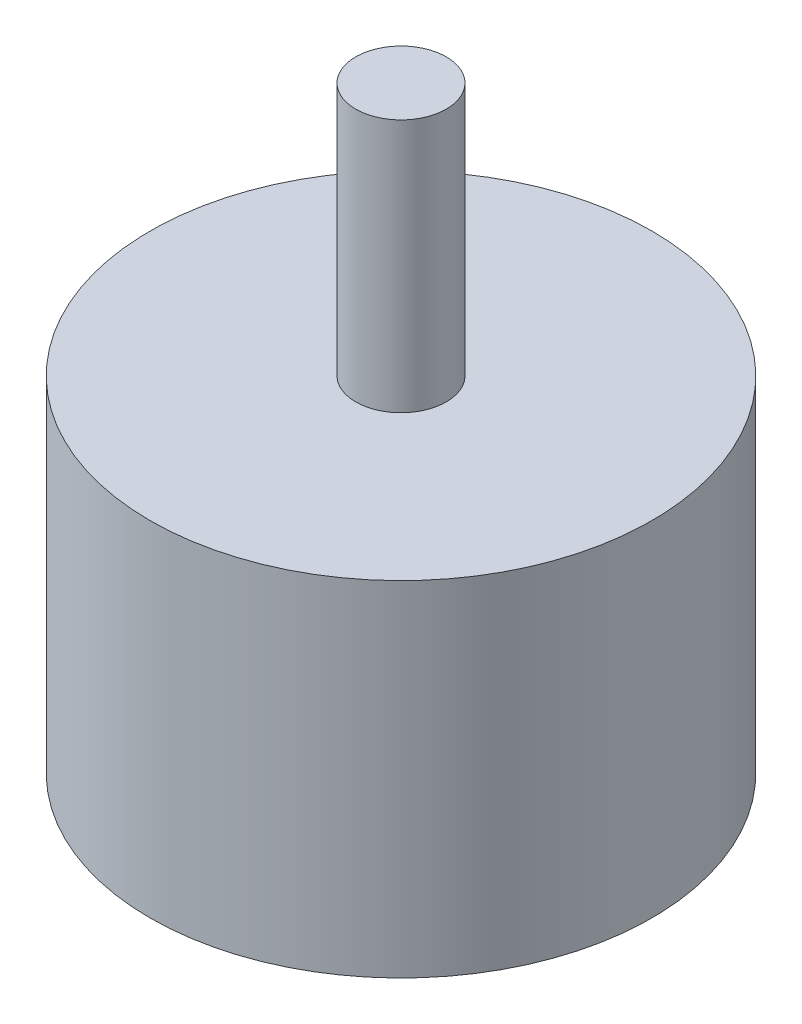
ISO-10303-21;
HEADER;
FILE_DESCRIPTION(('STEP AP214'),'2;1');
FILE_NAME('part.step','',(''),(''),'','','');
FILE_SCHEMA(('AUTOMOTIVE_DESIGN { 1 0 10303 214 1 1 1 1 }'));
ENDSEC;
DATA;
#1=APPLICATION_CONTEXT('core data for automotive mechanical design processes');
#2=APPLICATION_PROTOCOL_DEFINITION('international standard','automotive_design',2000,#1);
#3=PRODUCT_CONTEXT('',#1,'mechanical');
#4=PRODUCT('Part','Part','',(#3));
#5=PRODUCT_RELATED_PRODUCT_CATEGORY('part','',(#4));
#6=PRODUCT_DEFINITION_FORMATION('','',#4);
#7=PRODUCT_DEFINITION_CONTEXT('part definition',#1,'design');
#8=PRODUCT_DEFINITION('design','',#6,#7);
#9=PRODUCT_DEFINITION_SHAPE('','',#8);
#10=(LENGTH_UNIT() NAMED_UNIT(*) SI_UNIT(.MILLI.,.METRE.));
#11=(NAMED_UNIT(*) PLANE_ANGLE_UNIT() SI_UNIT($,.RADIAN.));
#12=(NAMED_UNIT(*) SI_UNIT($,.STERADIAN.) SOLID_ANGLE_UNIT());
#13=UNCERTAINTY_MEASURE_WITH_UNIT(LENGTH_MEASURE(1.E-05),#10,'distance_accuracy_value','');
#14=(GEOMETRIC_REPRESENTATION_CONTEXT(3) GLOBAL_UNCERTAINTY_ASSIGNED_CONTEXT((#13)) GLOBAL_UNIT_ASSIGNED_CONTEXT((#10,
#11,#12)) REPRESENTATION_CONTEXT('',''));
#15=CARTESIAN_POINT('',(0.,0.,0.));
#16=DIRECTION('',(0.,0.,1.));
#17=DIRECTION('',(1.,0.,0.));
#18=AXIS2_PLACEMENT_3D('',#15,#16,#17);
#19=CARTESIAN_POINT('',(0.,19.,0.));
#20=DIRECTION('',(0.,-1.,0.));
#21=DIRECTION('',(0.,0.,-1.));
#22=AXIS2_PLACEMENT_3D('',#19,#20,#21);
#23=CYLINDRICAL_SURFACE('',#22,13.85);
#24=CARTESIAN_POINT('',(0.,19.,0.));
#25=DIRECTION('',(0.,1.,0.));
#26=DIRECTION('',(0.,0.,1.));
#27=AXIS2_PLACEMENT_3D('',#24,#25,#26);
#28=CIRCLE('',#27,13.85);
#29=CARTESIAN_POINT('',(0.,19.,13.85));
#30=VERTEX_POINT('',#29);
#31=EDGE_CURVE('E11',#30,#30,#28,.T.);
#32=ORIENTED_EDGE('',*,*,#31,.F.);
#33=EDGE_LOOP('',(#32));
#34=FACE_BOUND('',#33,.T.);
#35=CARTESIAN_POINT('',(0.,0.,0.));
#36=DIRECTION('',(0.,1.,0.));
#37=DIRECTION('',(0.,0.,1.));
#38=AXIS2_PLACEMENT_3D('',#35,#36,#37);
#39=CIRCLE('',#38,13.85);
#40=CARTESIAN_POINT('',(0.,0.,13.85));
#41=VERTEX_POINT('',#40);
#42=EDGE_CURVE('E39',#41,#41,#39,.T.);
#43=ORIENTED_EDGE('',*,*,#42,.T.);
#44=EDGE_LOOP('',(#43));
#45=FACE_BOUND('',#44,.T.);
#46=ADVANCED_FACE('F36',(#34,#45),#23,.T.);
#47=CARTESIAN_POINT('',(0.,19.,0.));
#48=DIRECTION('',(0.,1.,0.));
#49=DIRECTION('',(0.,0.,1.));
#50=AXIS2_PLACEMENT_3D('',#47,#48,#49);
#51=PLANE('',#50);
#52=CARTESIAN_POINT('',(0.,19.,0.));
#53=DIRECTION('',(0.,1.,0.));
#54=DIRECTION('',(0.,0.,1.));
#55=AXIS2_PLACEMENT_3D('',#52,#53,#54);
#56=CIRCLE('',#55,2.5);
#57=CARTESIAN_POINT('',(0.,19.,2.5));
#58=VERTEX_POINT('',#57);
#59=EDGE_CURVE('E89',#58,#58,#56,.T.);
#60=ORIENTED_EDGE('',*,*,#59,.F.);
#61=EDGE_LOOP('',(#60));
#62=FACE_BOUND('',#61,.T.);
#63=ORIENTED_EDGE('',*,*,#31,.T.);
#64=EDGE_LOOP('',(#63));
#65=FACE_BOUND('',#64,.T.);
#66=ADVANCED_FACE('F98',(#62,#65),#51,.T.);
#67=CARTESIAN_POINT('',(0.,0.,0.));
#68=DIRECTION('',(0.,1.,0.));
#69=DIRECTION('',(0.,0.,1.));
#70=AXIS2_PLACEMENT_3D('',#67,#68,#69);
#71=PLANE('',#70);
#72=CARTESIAN_POINT('',(0.,0.,8.));
#73=DIRECTION('',(0.,-1.,0.));
#74=DIRECTION('',(0.,0.,-1.));
#75=AXIS2_PLACEMENT_3D('',#72,#73,#74);
#76=CIRCLE('',#75,1.24999999999999);
#77=CARTESIAN_POINT('',(0.,0.,6.75000000000001));
#78=VERTEX_POINT('',#77);
#79=EDGE_CURVE('E67',#78,#78,#76,.T.);
#80=ORIENTED_EDGE('',*,*,#79,.F.);
#81=EDGE_LOOP('',(#80));
#82=FACE_BOUND('',#81,.T.);
#83=CARTESIAN_POINT('',(-9.5,0.,0.));
#84=DIRECTION('',(0.,-1.,0.));
#85=DIRECTION('',(0.,0.,-1.));
#86=AXIS2_PLACEMENT_3D('',#83,#84,#85);
#87=CIRCLE('',#86,1.24999999999999);
#88=CARTESIAN_POINT('',(-9.5,0.,-1.24999999999999));
#89=VERTEX_POINT('',#88);
#90=EDGE_CURVE('E66',#89,#89,#87,.T.);
#91=ORIENTED_EDGE('',*,*,#90,.F.);
#92=EDGE_LOOP('',(#91));
#93=FACE_BOUND('',#92,.T.);
#94=CARTESIAN_POINT('',(0.,0.,-8.));
#95=DIRECTION('',(0.,-1.,0.));
#96=DIRECTION('',(0.,0.,-1.));
#97=AXIS2_PLACEMENT_3D('',#94,#95,#96);
#98=CIRCLE('',#97,1.24999999999999);
#99=CARTESIAN_POINT('',(0.,0.,-9.24999999999999));
#100=VERTEX_POINT('',#99);
#101=EDGE_CURVE('E77',#100,#100,#98,.T.);
#102=ORIENTED_EDGE('',*,*,#101,.F.);
#103=EDGE_LOOP('',(#102));
#104=FACE_BOUND('',#103,.T.);
#105=CARTESIAN_POINT('',(9.5,0.,0.));
#106=DIRECTION('',(0.,-1.,0.));
#107=DIRECTION('',(0.,0.,-1.));
#108=AXIS2_PLACEMENT_3D('',#105,#106,#107);
#109=CIRCLE('',#108,1.24999999999999);
#110=CARTESIAN_POINT('',(9.5,0.,-1.24999999999999));
#111=VERTEX_POINT('',#110);
#112=EDGE_CURVE('E83',#111,#111,#109,.T.);
#113=ORIENTED_EDGE('',*,*,#112,.F.);
#114=EDGE_LOOP('',(#113));
#115=FACE_BOUND('',#114,.T.);
#116=ORIENTED_EDGE('',*,*,#42,.F.);
#117=EDGE_LOOP('',(#116));
#118=FACE_BOUND('',#117,.T.);
#119=ADVANCED_FACE('F101',(#82,#93,#104,#115,#118),#71,.F.);
#120=CARTESIAN_POINT('',(0.,33.,0.));
#121=DIRECTION('',(0.,-1.,0.));
#122=DIRECTION('',(0.,0.,-1.));
#123=AXIS2_PLACEMENT_3D('',#120,#121,#122);
#124=CYLINDRICAL_SURFACE('',#123,2.5);
#125=CARTESIAN_POINT('',(0.,33.,0.));
#126=DIRECTION('',(0.,1.,0.));
#127=DIRECTION('',(0.,0.,1.));
#128=AXIS2_PLACEMENT_3D('',#125,#126,#127);
#129=CIRCLE('',#128,2.5);
#130=CARTESIAN_POINT('',(0.,33.,2.5));
#131=VERTEX_POINT('',#130);
#132=EDGE_CURVE('E90',#131,#131,#129,.T.);
#133=ORIENTED_EDGE('',*,*,#132,.F.);
#134=EDGE_LOOP('',(#133));
#135=FACE_BOUND('',#134,.T.);
#136=ORIENTED_EDGE('',*,*,#59,.T.);
#137=EDGE_LOOP('',(#136));
#138=FACE_BOUND('',#137,.T.);
#139=ADVANCED_FACE('F96',(#135,#138),#124,.T.);
#140=CARTESIAN_POINT('',(0.,33.,0.));
#141=DIRECTION('',(0.,1.,0.));
#142=DIRECTION('',(0.,0.,1.));
#143=AXIS2_PLACEMENT_3D('',#140,#141,#142);
#144=PLANE('',#143);
#145=ORIENTED_EDGE('',*,*,#132,.T.);
#146=EDGE_LOOP('',(#145));
#147=FACE_BOUND('',#146,.T.);
#148=ADVANCED_FACE('F115',(#147),#144,.T.);
#149=CARTESIAN_POINT('',(9.5,7.50000000000001,0.));
#150=DIRECTION('',(0.,-1.,0.));
#151=DIRECTION('',(0.,0.,-1.));
#152=AXIS2_PLACEMENT_3D('',#149,#150,#151);
#153=CONICAL_SURFACE('',#152,1.24999999999999,1.02974425867665);
#154=CARTESIAN_POINT('',(9.5,8.25107577378445,0.));
#155=VERTEX_POINT('',#154);
#156=VERTEX_LOOP('',#155);
#157=FACE_BOUND('',#156,.T.);
#158=CARTESIAN_POINT('',(9.5,7.50000000000001,0.));
#159=DIRECTION('',(0.,-1.,0.));
#160=DIRECTION('',(0.,0.,-1.));
#161=AXIS2_PLACEMENT_3D('',#158,#159,#160);
#162=CIRCLE('',#161,1.24999999999999);
#163=CARTESIAN_POINT('',(9.5,7.50000000000001,-1.24999999999999));
#164=VERTEX_POINT('',#163);
#165=EDGE_CURVE('E86',#164,#164,#162,.T.);
#166=ORIENTED_EDGE('',*,*,#165,.T.);
#167=EDGE_LOOP('',(#166));
#168=FACE_BOUND('',#167,.T.);
#169=ADVANCED_FACE('F123',(#157,#168),#153,.F.);
#170=CARTESIAN_POINT('',(9.5,0.,0.));
#171=DIRECTION('',(0.,-1.,0.));
#172=DIRECTION('',(0.,0.,-1.));
#173=AXIS2_PLACEMENT_3D('',#170,#171,#172);
#174=CYLINDRICAL_SURFACE('',#173,1.24999999999999);
#175=ORIENTED_EDGE('',*,*,#165,.F.);
#176=EDGE_LOOP('',(#175));
#177=FACE_BOUND('',#176,.T.);
#178=ORIENTED_EDGE('',*,*,#112,.T.);
#179=EDGE_LOOP('',(#178));
#180=FACE_BOUND('',#179,.T.);
#181=ADVANCED_FACE('F127',(#177,#180),#174,.F.);
#182=CARTESIAN_POINT('',(0.,7.50000000000001,-8.));
#183=DIRECTION('',(0.,-1.,0.));
#184=DIRECTION('',(0.,0.,-1.));
#185=AXIS2_PLACEMENT_3D('',#182,#183,#184);
#186=CONICAL_SURFACE('',#185,1.24999999999999,1.02974425867665);
#187=CARTESIAN_POINT('',(0.,8.25107577378445,-8.));
#188=VERTEX_POINT('',#187);
#189=VERTEX_LOOP('',#188);
#190=FACE_BOUND('',#189,.T.);
#191=CARTESIAN_POINT('',(0.,7.50000000000001,-8.));
#192=DIRECTION('',(0.,-1.,0.));
#193=DIRECTION('',(0.,0.,-1.));
#194=AXIS2_PLACEMENT_3D('',#191,#192,#193);
#195=CIRCLE('',#194,1.24999999999999);
#196=CARTESIAN_POINT('',(0.,7.50000000000001,-9.24999999999999));
#197=VERTEX_POINT('',#196);
#198=EDGE_CURVE('E80',#197,#197,#195,.T.);
#199=ORIENTED_EDGE('',*,*,#198,.T.);
#200=EDGE_LOOP('',(#199));
#201=FACE_BOUND('',#200,.T.);
#202=ADVANCED_FACE('F130',(#190,#201),#186,.F.);
#203=CARTESIAN_POINT('',(0.,0.,-8.));
#204=DIRECTION('',(0.,-1.,0.));
#205=DIRECTION('',(0.,0.,-1.));
#206=AXIS2_PLACEMENT_3D('',#203,#204,#205);
#207=CYLINDRICAL_SURFACE('',#206,1.24999999999999);
#208=ORIENTED_EDGE('',*,*,#198,.F.);
#209=EDGE_LOOP('',(#208));
#210=FACE_BOUND('',#209,.T.);
#211=ORIENTED_EDGE('',*,*,#101,.T.);
#212=EDGE_LOOP('',(#211));
#213=FACE_BOUND('',#212,.T.);
#214=ADVANCED_FACE('F134',(#210,#213),#207,.F.);
#215=CARTESIAN_POINT('',(-9.5,7.50000000000001,0.));
#216=DIRECTION('',(0.,-1.,0.));
#217=DIRECTION('',(0.,0.,-1.));
#218=AXIS2_PLACEMENT_3D('',#215,#216,#217);
#219=CONICAL_SURFACE('',#218,1.24999999999999,1.02974425867665);
#220=CARTESIAN_POINT('',(-9.5,8.25107577378445,0.));
#221=VERTEX_POINT('',#220);
#222=VERTEX_LOOP('',#221);
#223=FACE_BOUND('',#222,.T.);
#224=CARTESIAN_POINT('',(-9.5,7.50000000000001,0.));
#225=DIRECTION('',(0.,-1.,0.));
#226=DIRECTION('',(0.,0.,-1.));
#227=AXIS2_PLACEMENT_3D('',#224,#225,#226);
#228=CIRCLE('',#227,1.24999999999999);
#229=CARTESIAN_POINT('',(-9.5,7.50000000000001,-1.24999999999999));
#230=VERTEX_POINT('',#229);
#231=EDGE_CURVE('E70',#230,#230,#228,.T.);
#232=ORIENTED_EDGE('',*,*,#231,.T.);
#233=EDGE_LOOP('',(#232));
#234=FACE_BOUND('',#233,.T.);
#235=ADVANCED_FACE('F137',(#223,#234),#219,.F.);
#236=CARTESIAN_POINT('',(-9.5,0.,0.));
#237=DIRECTION('',(0.,-1.,0.));
#238=DIRECTION('',(0.,0.,-1.));
#239=AXIS2_PLACEMENT_3D('',#236,#237,#238);
#240=CYLINDRICAL_SURFACE('',#239,1.24999999999999);
#241=ORIENTED_EDGE('',*,*,#231,.F.);
#242=EDGE_LOOP('',(#241));
#243=FACE_BOUND('',#242,.T.);
#244=ORIENTED_EDGE('',*,*,#90,.T.);
#245=EDGE_LOOP('',(#244));
#246=FACE_BOUND('',#245,.T.);
#247=ADVANCED_FACE('F60',(#243,#246),#240,.F.);
#248=CARTESIAN_POINT('',(0.,7.50000000000001,8.));
#249=DIRECTION('',(0.,-1.,0.));
#250=DIRECTION('',(0.,0.,-1.));
#251=AXIS2_PLACEMENT_3D('',#248,#249,#250);
#252=CONICAL_SURFACE('',#251,1.24999999999999,1.02974425867665);
#253=CARTESIAN_POINT('',(0.,8.25107577378445,8.));
#254=VERTEX_POINT('',#253);
#255=VERTEX_LOOP('',#254);
#256=FACE_BOUND('',#255,.T.);
#257=CARTESIAN_POINT('',(0.,7.50000000000001,8.));
#258=DIRECTION('',(0.,-1.,0.));
#259=DIRECTION('',(0.,0.,-1.));
#260=AXIS2_PLACEMENT_3D('',#257,#258,#259);
#261=CIRCLE('',#260,1.24999999999999);
#262=CARTESIAN_POINT('',(0.,7.50000000000001,6.75000000000001));
#263=VERTEX_POINT('',#262);
#264=EDGE_CURVE('E64',#263,#263,#261,.T.);
#265=ORIENTED_EDGE('',*,*,#264,.T.);
#266=EDGE_LOOP('',(#265));
#267=FACE_BOUND('',#266,.T.);
#268=ADVANCED_FACE('F56',(#256,#267),#252,.F.);
#269=CARTESIAN_POINT('',(0.,0.,8.));
#270=DIRECTION('',(0.,-1.,0.));
#271=DIRECTION('',(0.,0.,-1.));
#272=AXIS2_PLACEMENT_3D('',#269,#270,#271);
#273=CYLINDRICAL_SURFACE('',#272,1.24999999999999);
#274=ORIENTED_EDGE('',*,*,#264,.F.);
#275=EDGE_LOOP('',(#274));
#276=FACE_BOUND('',#275,.T.);
#277=ORIENTED_EDGE('',*,*,#79,.T.);
#278=EDGE_LOOP('',(#277));
#279=FACE_BOUND('',#278,.T.);
#280=ADVANCED_FACE('F59',(#276,#279),#273,.F.);
#281=CLOSED_SHELL('',(#46,#66,#119,#139,#148,#169,#181,#202,#214,#235,#247,#268,#280));
#282=MANIFOLD_SOLID_BREP('B2',#281);
#283=ADVANCED_BREP_SHAPE_REPRESENTATION('',(#18,#282),#14);
#284=SHAPE_DEFINITION_REPRESENTATION(#9,#283);
ENDSEC;
END-ISO-10303-21;
